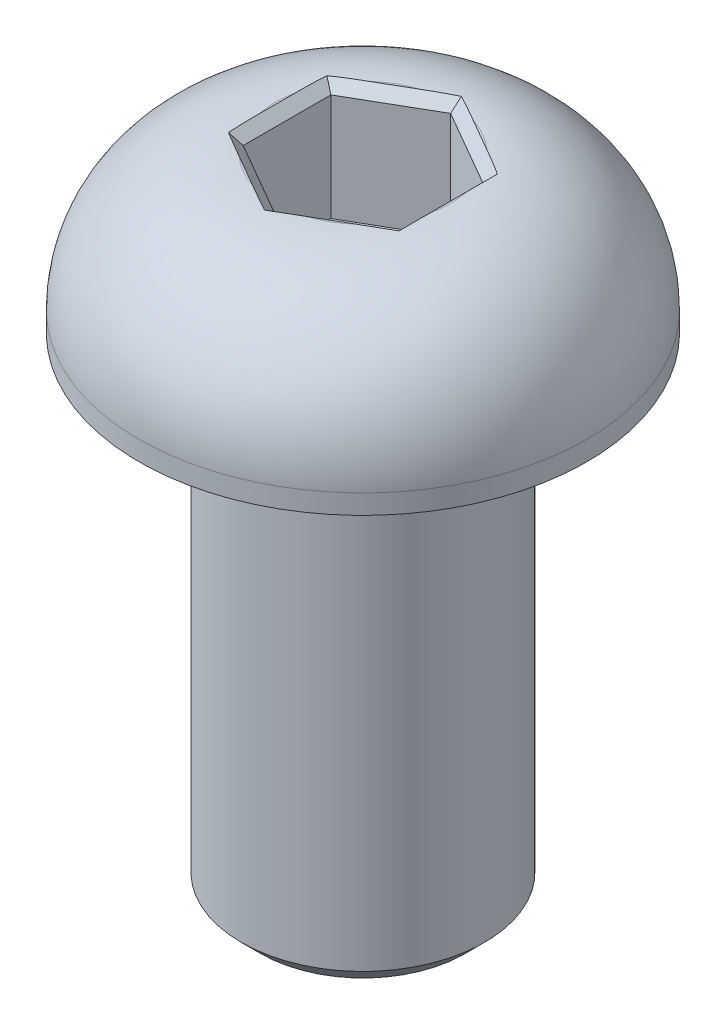
ISO-10303-21;
HEADER;
FILE_DESCRIPTION(('STEP AP214'),'2;1');
FILE_NAME('part.step','',(''),(''),'','','');
FILE_SCHEMA(('AUTOMOTIVE_DESIGN { 1 0 10303 214 1 1 1 1 }'));
ENDSEC;
DATA;
#1=APPLICATION_CONTEXT('core data for automotive mechanical design processes');
#2=APPLICATION_PROTOCOL_DEFINITION('international standard','automotive_design',2000,#1);
#3=PRODUCT_CONTEXT('',#1,'mechanical');
#4=PRODUCT('Part','Part','',(#3));
#5=PRODUCT_RELATED_PRODUCT_CATEGORY('part','',(#4));
#6=PRODUCT_DEFINITION_FORMATION('','',#4);
#7=PRODUCT_DEFINITION_CONTEXT('part definition',#1,'design');
#8=PRODUCT_DEFINITION('design','',#6,#7);
#9=PRODUCT_DEFINITION_SHAPE('','',#8);
#10=(LENGTH_UNIT() NAMED_UNIT(*) SI_UNIT(.MILLI.,.METRE.));
#11=(NAMED_UNIT(*) PLANE_ANGLE_UNIT() SI_UNIT($,.RADIAN.));
#12=(NAMED_UNIT(*) SI_UNIT($,.STERADIAN.) SOLID_ANGLE_UNIT());
#13=UNCERTAINTY_MEASURE_WITH_UNIT(LENGTH_MEASURE(1.E-05),#10,'distance_accuracy_value','');
#14=(GEOMETRIC_REPRESENTATION_CONTEXT(3) GLOBAL_UNCERTAINTY_ASSIGNED_CONTEXT((#13)) GLOBAL_UNIT_ASSIGNED_CONTEXT((#10,
#11,#12)) REPRESENTATION_CONTEXT('',''));
#15=CARTESIAN_POINT('',(0.,0.,0.));
#16=DIRECTION('',(0.,0.,1.));
#17=DIRECTION('',(1.,0.,0.));
#18=AXIS2_PLACEMENT_3D('',#15,#16,#17);
#19=CARTESIAN_POINT('',(-2.23519999999999,0.,0.));
#20=DIRECTION('',(-0.707106781186548,-0.707106781186548,0.));
#21=DIRECTION('',(0.707106781186548,-0.707106781186548,0.));
#22=AXIS2_PLACEMENT_3D('',#19,#20,#21);
#23=PLANE('',#22);
#24=CARTESIAN_POINT('',(-2.23519999999999,0.,-0.479246241508528));
#25=CARTESIAN_POINT('',(-2.23519545083094,-4.5491690521561E-06,-0.54633187498132));
#26=CARTESIAN_POINT('',(-2.23511717405976,-8.28259402306092E-05,-0.6134198498157));
#27=CARTESIAN_POINT('',(-2.23457539898931,-0.00062460101068055,-0.747580394081407));
#28=CARTESIAN_POINT('',(-2.23411196867061,-0.00108803132938383,-0.814652964142137));
#29=CARTESIAN_POINT('',(-2.23256218352199,-0.00263781647800325,-0.948795198174681));
#30=CARTESIAN_POINT('',(-2.23147574598861,-0.00372425401137726,-1.01586486057811));
#31=CARTESIAN_POINT('',(-2.22844173806789,-0.00675826193210111,-1.14997607876352));
#32=CARTESIAN_POINT('',(-2.22649401532764,-0.00870598467234656,-1.21701762747143));
#33=CARTESIAN_POINT('',(-2.22399670617113,-0.0112032938288596,-1.28402509698474));
#34=B_SPLINE_CURVE_WITH_KNOTS('',3,(#24,#25,#26,#27,#28,#29,#30,#31,#32,#33),.UNSPECIFIED.,.F.,
.F.,(4,2,2,2,4),(0.,0.201260421356997,0.402485327286571,0.603736951766037,0.805024189931098),.UNSPECIFIED.);
#35=CARTESIAN_POINT('',(-2.23519999999999,0.,-0.479246241508529));
#36=VERTEX_POINT('',#35);
#37=CARTESIAN_POINT('',(-2.22399670617113,-0.0112032938288605,-1.28402509698474));
#38=VERTEX_POINT('',#37);
#39=EDGE_CURVE('E143',#36,#38,#34,.T.);
#40=ORIENTED_EDGE('',*,*,#39,.F.);
#41=DIRECTION('',(0.,0.,1.));
#42=VECTOR('',#41,1.);
#43=CARTESIAN_POINT('',(-2.23519999999999,0.,0.));
#44=LINE('',#43,#42);
#45=CARTESIAN_POINT('',(-2.23519999999999,0.,0.479246241508528));
#46=VERTEX_POINT('',#45);
#47=EDGE_CURVE('E114',#46,#36,#44,.F.);
#48=ORIENTED_EDGE('',*,*,#47,.F.);
#49=CARTESIAN_POINT('',(-2.22399670617113,-0.0112032938288608,1.28402509698477));
#50=CARTESIAN_POINT('',(-2.22649401532764,-0.00870598467234749,1.21701762747146));
#51=CARTESIAN_POINT('',(-2.22844173806789,-0.00675826193210184,1.14997607876355));
#52=CARTESIAN_POINT('',(-2.23147574598861,-0.00372425401137765,1.01586486057813));
#53=CARTESIAN_POINT('',(-2.23256218352199,-0.0026378164780035,0.948795198174698));
#54=CARTESIAN_POINT('',(-2.23411196867061,-0.00108803132938387,0.814652964142149));
#55=CARTESIAN_POINT('',(-2.23457539898931,-0.000624601010680516,0.747580394081417));
#56=CARTESIAN_POINT('',(-2.23511717405976,-8.28259402305098E-05,0.613419849815705));
#57=CARTESIAN_POINT('',(-2.23519545083094,-4.54916905205781E-06,0.546331874981322));
#58=CARTESIAN_POINT('',(-2.23519999999999,0.,0.479246241508528));
#59=B_SPLINE_CURVE_WITH_KNOTS('',3,(#49,#50,#51,#52,#53,#54,#55,#56,#57,#58),.UNSPECIFIED.,.F.,
.F.,(4,2,2,2,4),(0.,0.201287238165069,0.402538862644542,0.603763768574124,0.805024189931128),.UNSPECIFIED.);
#60=CARTESIAN_POINT('',(-2.22399670617113,-0.0112032938288608,1.28402509698476));
#61=VERTEX_POINT('',#60);
#62=EDGE_CURVE('E21',#61,#46,#59,.T.);
#63=ORIENTED_EDGE('',*,*,#62,.F.);
#64=DIRECTION('',(0.654653670707967,-0.654653670707981,-0.377964473009239));
#65=VECTOR('',#64,1.);
#66=CARTESIAN_POINT('',(-2.22399670617113,-0.0112032938288579,1.28402509698476));
#67=LINE('',#66,#65);
#68=CARTESIAN_POINT('',(-1.98119999999999,-0.254000000000002,1.14384635331849));
#69=VERTEX_POINT('',#68);
#70=EDGE_CURVE('E105',#61,#69,#67,.T.);
#71=ORIENTED_EDGE('',*,*,#70,.T.);
#72=DIRECTION('',(0.,0.,-1.));
#73=VECTOR('',#72,1.);
#74=CARTESIAN_POINT('',(-1.98119999999999,-0.254000000000001,1.14384635331849));
#75=LINE('',#74,#73);
#76=CARTESIAN_POINT('',(-1.98119999999999,-0.254000000000001,-1.14384635331848));
#77=VERTEX_POINT('',#76);
#78=EDGE_CURVE('E163',#77,#69,#75,.F.);
#79=ORIENTED_EDGE('',*,*,#78,.F.);
#80=DIRECTION('',(-0.654653670707978,0.654653670707976,-0.377964473009226));
#81=VECTOR('',#80,1.);
#82=CARTESIAN_POINT('',(-1.98119999999999,-0.254000000000002,-1.14384635331848));
#83=LINE('',#82,#81);
#84=EDGE_CURVE('E353',#77,#38,#83,.T.);
#85=ORIENTED_EDGE('',*,*,#84,.T.);
#86=EDGE_LOOP('',(#40,#48,#63,#71,#79,#85));
#87=FACE_BOUND('',#86,.T.);
#88=ADVANCED_FACE('F16',(#87),#23,.F.);
#89=CARTESIAN_POINT('',(1.1176,0.,1.93573998253899));
#90=DIRECTION('',(0.353553390593274,-0.707106781186548,0.612372435695794));
#91=DIRECTION('',(0.,-0.654653670707977,-0.755928946018455));
#92=AXIS2_PLACEMENT_3D('',#89,#90,#91);
#93=PLANE('',#92);
#94=CARTESIAN_POINT('',(0.702560580185507,0.,2.17536310329319));
#95=CARTESIAN_POINT('',(0.644460442784563,-4.54916905213066E-06,2.20890198033363));
#96=CARTESIAN_POINT('',(0.58632141390394,-8.28259402305223E-05,2.24237817807846));
#97=CARTESIAN_POINT('',(0.469864086849047,-0.000624601010680477,2.30898925923718));
#98=CARTESIAN_POINT('',(0.411545822119983,-0.00108803132938384,2.34212420183867));
#99=CARTESIAN_POINT('',(0.294600347153073,-0.00263781647800355,2.40785316554584));
#100=CARTESIAN_POINT('',(0.23597309692176,-0.00372425401137779,2.44044711424403));
#101=CARTESIAN_POINT('',(0.118312371080335,-0.00675826193210222,2.50487519540212));
#102=CARTESIAN_POINT('',(0.0592788254201039,-0.00870598467234802,2.53670919238349));
#103=CARTESIAN_POINT('',(0.,-0.0112032938288615,2.56805019396951));
#104=B_SPLINE_CURVE_WITH_KNOTS('',3,(#94,#95,#96,#97,#98,#99,#100,#101,#102,#103),.UNSPECIFIED.,
.F.,.F.,(4,2,2,2,4),(0.,0.201260421357029,0.402485327286636,0.603736951766134,
0.805024189931228),.UNSPECIFIED.);
#105=CARTESIAN_POINT('',(0.702560580185491,0.,2.1753631032932));
#106=VERTEX_POINT('',#105);
#107=CARTESIAN_POINT('',(0.,-0.0112032938288617,2.56805019396951));
#108=VERTEX_POINT('',#107);
#109=EDGE_CURVE('E136',#106,#108,#104,.T.);
#110=ORIENTED_EDGE('',*,*,#109,.F.);
#111=DIRECTION('',(-0.866025403784439,0.,0.5));
#112=VECTOR('',#111,1.);
#113=CARTESIAN_POINT('',(1.53263941981452,0.,1.69611686178477));
#114=LINE('',#113,#112);
#115=CARTESIAN_POINT('',(1.53263941981452,0.,1.69611686178477));
#116=VERTEX_POINT('',#115);
#117=EDGE_CURVE('E139',#116,#106,#114,.T.);
#118=ORIENTED_EDGE('',*,*,#117,.F.);
#119=CARTESIAN_POINT('',(2.22399670617116,-0.0112032938288619,1.28402509698474));
#120=CARTESIAN_POINT('',(2.16721518990757,-0.00870598467234795,1.31969156491205));
#121=CARTESIAN_POINT('',(2.11012936698759,-0.00675826193210205,1.35489911663859));
#122=CARTESIAN_POINT('',(1.99550264906689,-0.00372425401137771,1.42458225366594));
#123=CARTESIAN_POINT('',(1.93796183636895,-0.00263781647800366,1.45905796737118));
#124=CARTESIAN_POINT('',(1.82256614655066,-0.00108803132938403,1.52747123769658));
#125=CARTESIAN_POINT('',(1.7647113121403,-0.000624601010680579,1.56140886515583));
#126=CARTESIAN_POINT('',(1.64879576015586,-8.28259402304328E-05,1.62895832826284));
#127=CARTESIAN_POINT('',(1.59073500804641,-4.54916905194507E-06,1.6625701053524));
#128=CARTESIAN_POINT('',(1.53263941981452,0.,1.69611686178477));
#129=B_SPLINE_CURVE_WITH_KNOTS('',3,(#119,#120,#121,#122,#123,#124,#125,#126,#127,#128),
.UNSPECIFIED.,.F.,.F.,(4,2,2,2,4),(0.,0.201287238165093,0.40253886264459,0.603763768574196,
0.805024189931224),.UNSPECIFIED.);
#130=CARTESIAN_POINT('',(2.22399670617116,-0.0112032938288619,1.28402509698475));
#131=VERTEX_POINT('',#130);
#132=EDGE_CURVE('E141',#131,#116,#129,.T.);
#133=ORIENTED_EDGE('',*,*,#132,.F.);
#134=DIRECTION('',(-0.654653670707979,-0.654653670707979,-0.377964473009222));
#135=VECTOR('',#134,1.);
#136=CARTESIAN_POINT('',(2.22399670617115,-0.0112032938288602,1.28402509698475));
#137=LINE('',#136,#135);
#138=CARTESIAN_POINT('',(1.98120000000001,-0.254000000000001,1.14384635331849));
#139=VERTEX_POINT('',#138);
#140=EDGE_CURVE('E123',#131,#139,#137,.T.);
#141=ORIENTED_EDGE('',*,*,#140,.T.);
#142=DIRECTION('',(-0.866025403784439,0.,0.5));
#143=VECTOR('',#142,1.);
#144=CARTESIAN_POINT('',(1.98120000000001,-0.254,1.14384635331849));
#145=LINE('',#144,#143);
#146=CARTESIAN_POINT('',(0.,-0.254000000000001,2.28769270663698));
#147=VERTEX_POINT('',#146);
#148=EDGE_CURVE('E165',#147,#139,#145,.F.);
#149=ORIENTED_EDGE('',*,*,#148,.F.);
#150=DIRECTION('',(0.,-0.654653670707977,-0.755928946018455));
#151=VECTOR('',#150,1.);
#152=CARTESIAN_POINT('',(0.,-0.319314285714288,2.21227426575884));
#153=LINE('',#152,#151);
#154=EDGE_CURVE('E133',#147,#108,#153,.F.);
#155=ORIENTED_EDGE('',*,*,#154,.T.);
#156=EDGE_LOOP('',(#110,#118,#133,#141,#149,#155));
#157=FACE_BOUND('',#156,.T.);
#158=ADVANCED_FACE('F374',(#157),#93,.F.);
#159=CARTESIAN_POINT('',(-1.1176,0.,1.93573998253898));
#160=DIRECTION('',(-0.353553390593274,-0.707106781186548,0.612372435695794));
#161=DIRECTION('',(0.,-0.654653670707977,-0.755928946018455));
#162=AXIS2_PLACEMENT_3D('',#159,#160,#161);
#163=PLANE('',#162);
#164=CARTESIAN_POINT('',(-1.53263941981454,0.,1.69611686178475));
#165=CARTESIAN_POINT('',(-1.59073500804643,-4.54916905217606E-06,1.66257010535238));
#166=CARTESIAN_POINT('',(-1.64879576015587,-8.28259402304666E-05,1.62895832826283));
#167=CARTESIAN_POINT('',(-1.7647113121403,-0.000624601010680219,1.56140886515582));
#168=CARTESIAN_POINT('',(-1.82256614655066,-0.00108803132938348,1.52747123769657));
#169=CARTESIAN_POINT('',(-1.93796183636894,-0.00263781647800301,1.45905796737118));
#170=CARTESIAN_POINT('',(-1.99550264906688,-0.00372425401137715,1.42458225366593));
#171=CARTESIAN_POINT('',(-2.11012936698757,-0.00675826193210139,1.35489911663859));
#172=CARTESIAN_POINT('',(-2.16721518990755,-0.0087059846723471,1.31969156491205));
#173=CARTESIAN_POINT('',(-2.22399670617114,-0.0112032938288604,1.28402509698475));
#174=B_SPLINE_CURVE_WITH_KNOTS('',3,(#164,#165,#166,#167,#168,#169,#170,#171,#172,#173),
.UNSPECIFIED.,.F.,.F.,(4,2,2,2,4),(0.,0.201260421357015,0.402485327286608,0.603736951766091,
0.805024189931171),.UNSPECIFIED.);
#175=CARTESIAN_POINT('',(-1.53263941981454,0.,1.69611686178475));
#176=VERTEX_POINT('',#175);
#177=EDGE_CURVE('E94',#176,#61,#174,.T.);
#178=ORIENTED_EDGE('',*,*,#177,.F.);
#179=DIRECTION('',(-0.866025403784439,0.,-0.5));
#180=VECTOR('',#179,1.);
#181=CARTESIAN_POINT('',(-0.702560580185463,0.,2.17536310329321));
#182=LINE('',#181,#180);
#183=CARTESIAN_POINT('',(-0.702560580185463,0.,2.17536310329321));
#184=VERTEX_POINT('',#183);
#185=EDGE_CURVE('E106',#184,#176,#182,.T.);
#186=ORIENTED_EDGE('',*,*,#185,.F.);
#187=CARTESIAN_POINT('',(0.,-0.011203293828861,2.56805019396951));
#188=CARTESIAN_POINT('',(-0.0592788254200909,-0.00870598467234772,2.53670919238349));
#189=CARTESIAN_POINT('',(-0.118312371080319,-0.00675826193210203,2.50487519540211));
#190=CARTESIAN_POINT('',(-0.235973096921738,-0.00372425401137776,2.44044711424403));
#191=CARTESIAN_POINT('',(-0.294600347153048,-0.00263781647800358,2.40785316554584));
#192=CARTESIAN_POINT('',(-0.411545822119952,-0.00108803132938388,2.34212420183867));
#193=CARTESIAN_POINT('',(-0.469864086849014,-0.000624601010680494,2.30898925923719));
#194=CARTESIAN_POINT('',(-0.586321413903901,-8.28259402304026E-05,2.24237817807847));
#195=CARTESIAN_POINT('',(-0.644460442784521,-4.54916905190398E-06,2.20890198033364));
#196=CARTESIAN_POINT('',(-0.702560580185462,0.,2.17536310329321));
#197=B_SPLINE_CURVE_WITH_KNOTS('',3,(#187,#188,#189,#190,#191,#192,#193,#194,#195,#196),
.UNSPECIFIED.,.F.,.F.,(4,2,2,2,4),(0.,0.201287238165084,0.402538862644572,0.603763768574169,
0.805024189931188),.UNSPECIFIED.);
#198=EDGE_CURVE('E132',#108,#184,#197,.T.);
#199=ORIENTED_EDGE('',*,*,#198,.F.);
#200=ORIENTED_EDGE('',*,*,#154,.F.);
#201=DIRECTION('',(-0.866025403784439,0.,-0.5));
#202=VECTOR('',#201,1.);
#203=CARTESIAN_POINT('',(0.,-0.254,2.28769270663698));
#204=LINE('',#203,#202);
#205=EDGE_CURVE('E119',#69,#147,#204,.F.);
#206=ORIENTED_EDGE('',*,*,#205,.F.);
#207=ORIENTED_EDGE('',*,*,#70,.F.);
#208=EDGE_LOOP('',(#178,#186,#199,#200,#206,#207));
#209=FACE_BOUND('',#208,.T.);
#210=ADVANCED_FACE('F116',(#209),#163,.F.);
#211=CARTESIAN_POINT('',(2.23520000000001,0.,0.));
#212=DIRECTION('',(0.707106781186548,-0.707106781186548,0.));
#213=DIRECTION('',(0.707106781186548,0.707106781186548,0.));
#214=AXIS2_PLACEMENT_3D('',#211,#212,#213);
#215=PLANE('',#214);
#216=CARTESIAN_POINT('',(2.22399670617115,-0.0112032938288609,-1.28402509698474));
#217=CARTESIAN_POINT('',(2.22649401532766,-0.00870598467234712,-1.21701762747142));
#218=CARTESIAN_POINT('',(2.22844173806791,-0.00675826193210139,-1.14997607876351));
#219=CARTESIAN_POINT('',(2.23147574598863,-0.00372425401137733,-1.01586486057808));
#220=CARTESIAN_POINT('',(2.23256218352201,-0.00263781647800338,-0.948795198174644));
#221=CARTESIAN_POINT('',(2.23411196867063,-0.00108803132938389,-0.814652964142084));
#222=CARTESIAN_POINT('',(2.23457539898933,-0.000624601010680465,-0.747580394081347));
#223=CARTESIAN_POINT('',(2.23511717405978,-8.28259402303114E-05,-0.613419849815625));
#224=CARTESIAN_POINT('',(2.23519545083096,-4.54916905178455E-06,-0.546331874981238));
#225=CARTESIAN_POINT('',(2.23520000000001,0.,-0.479246241508439));
#226=B_SPLINE_CURVE_WITH_KNOTS('',3,(#216,#217,#218,#219,#220,#221,#222,#223,#224,#225),
.UNSPECIFIED.,.F.,.F.,(4,2,2,2,4),(0.,0.201287238165083,0.402538862644571,0.603763768574168,
0.805024189931187),.UNSPECIFIED.);
#227=CARTESIAN_POINT('',(2.22399670617115,-0.0112032938288607,-1.28402509698474));
#228=VERTEX_POINT('',#227);
#229=CARTESIAN_POINT('',(2.23520000000001,0.,-0.479246241508439));
#230=VERTEX_POINT('',#229);
#231=EDGE_CURVE('E354',#228,#230,#226,.T.);
#232=ORIENTED_EDGE('',*,*,#231,.F.);
#233=DIRECTION('',(0.654653670707979,0.654653670707979,-0.377964473009222));
#234=VECTOR('',#233,1.);
#235=CARTESIAN_POINT('',(1.98120000000001,-0.254,-1.14384635331848));
#236=LINE('',#235,#234);
#237=CARTESIAN_POINT('',(1.98120000000001,-0.254000000000001,-1.14384635331848));
#238=VERTEX_POINT('',#237);
#239=EDGE_CURVE('E359',#238,#228,#236,.T.);
#240=ORIENTED_EDGE('',*,*,#239,.F.);
#241=DIRECTION('',(0.,0.,1.));
#242=VECTOR('',#241,1.);
#243=CARTESIAN_POINT('',(1.98120000000001,-0.254000000000001,-1.14384635331848));
#244=LINE('',#243,#242);
#245=EDGE_CURVE('E148',#139,#238,#244,.F.);
#246=ORIENTED_EDGE('',*,*,#245,.F.);
#247=ORIENTED_EDGE('',*,*,#140,.F.);
#248=CARTESIAN_POINT('',(2.23520000000001,0.,0.479246241508439));
#249=CARTESIAN_POINT('',(2.23519545083096,-4.54916905199079E-06,0.54633187498124));
#250=CARTESIAN_POINT('',(2.23511717405978,-8.2825940230476E-05,0.613419849815629));
#251=CARTESIAN_POINT('',(2.23457539898933,-0.00062460101068062,0.747580394081356));
#252=CARTESIAN_POINT('',(2.23411196867063,-0.00108803132938407,0.814652964142094));
#253=CARTESIAN_POINT('',(2.23256218352201,-0.00263781647800372,0.948795198174658));
#254=CARTESIAN_POINT('',(2.23147574598863,-0.00372425401137778,1.0158648605781));
#255=CARTESIAN_POINT('',(2.22844173806791,-0.00675826193210213,1.14997607876353));
#256=CARTESIAN_POINT('',(2.22649401532766,-0.00870598467234803,1.21701762747144));
#257=CARTESIAN_POINT('',(2.22399670617115,-0.011203293828862,1.28402509698476));
#258=B_SPLINE_CURVE_WITH_KNOTS('',3,(#248,#249,#250,#251,#252,#253,#254,#255,#256,#257),
.UNSPECIFIED.,.F.,.F.,(4,2,2,2,4),(0.,0.201260421357025,0.402485327286628,0.603736951766122,
0.805024189931211),.UNSPECIFIED.);
#259=CARTESIAN_POINT('',(2.23520000000001,0.,0.479246241508439));
#260=VERTEX_POINT('',#259);
#261=EDGE_CURVE('E121',#260,#131,#258,.T.);
#262=ORIENTED_EDGE('',*,*,#261,.F.);
#263=DIRECTION('',(0.,0.,1.));
#264=VECTOR('',#263,1.);
#265=CARTESIAN_POINT('',(2.23520000000001,0.,0.));
#266=LINE('',#265,#264);
#267=EDGE_CURVE('E358',#230,#260,#266,.T.);
#268=ORIENTED_EDGE('',*,*,#267,.F.);
#269=EDGE_LOOP('',(#232,#240,#246,#247,#262,#268));
#270=FACE_BOUND('',#269,.T.);
#271=ADVANCED_FACE('F337',(#270),#215,.F.);
#272=CARTESIAN_POINT('',(-1.1176,0.,-1.93573998253897));
#273=DIRECTION('',(-0.353553390593274,-0.707106781186548,-0.612372435695794));
#274=DIRECTION('',(0.,0.654653670707977,-0.755928946018455));
#275=AXIS2_PLACEMENT_3D('',#272,#273,#274);
#276=PLANE('',#275);
#277=CARTESIAN_POINT('',(-0.702560580185405,0.,-2.17536310329323));
#278=CARTESIAN_POINT('',(-0.644460442784469,-4.54916905177024E-06,-2.20890198033366));
#279=CARTESIAN_POINT('',(-0.586321413903855,-8.28259402302688E-05,-2.24237817807849));
#280=CARTESIAN_POINT('',(-0.469864086848978,-0.000624601010680577,-2.3089892592372));
#281=CARTESIAN_POINT('',(-0.411545822119921,-0.00108803132938418,-2.34212420183868));
#282=CARTESIAN_POINT('',(-0.294600347153028,-0.00263781647800368,-2.40785316554584));
#283=CARTESIAN_POINT('',(-0.235973096921723,-0.00372425401137744,-2.44044711424403));
#284=CARTESIAN_POINT('',(-0.118312371080315,-0.00675826193210108,-2.50487519540211));
#285=CARTESIAN_POINT('',(-0.0592788254200919,-0.00870598467234657,-2.53670919238348));
#286=CARTESIAN_POINT('',(0.,-0.0112032938288602,-2.56805019396949));
#287=B_SPLINE_CURVE_WITH_KNOTS('',3,(#277,#278,#279,#280,#281,#282,#283,#284,#285,#286),
.UNSPECIFIED.,.F.,.F.,(4,2,2,2,4),(0.,0.201260421357001,0.40248532728658,0.60373695176605,
0.805024189931116),.UNSPECIFIED.);
#288=CARTESIAN_POINT('',(-0.702560580185404,0.,-2.17536310329323));
#289=VERTEX_POINT('',#288);
#290=CARTESIAN_POINT('',(0.,-0.0112032938288604,-2.5680501939695));
#291=VERTEX_POINT('',#290);
#292=EDGE_CURVE('E342',#289,#291,#287,.T.);
#293=ORIENTED_EDGE('',*,*,#292,.F.);
#294=DIRECTION('',(0.866025403784439,0.,-0.499999999999999));
#295=VECTOR('',#294,1.);
#296=CARTESIAN_POINT('',(-1.53263941981459,0.,-1.69611686178471));
#297=LINE('',#296,#295);
#298=CARTESIAN_POINT('',(-1.53263941981459,0.,-1.69611686178471));
#299=VERTEX_POINT('',#298);
#300=EDGE_CURVE('E352',#299,#289,#297,.T.);
#301=ORIENTED_EDGE('',*,*,#300,.F.);
#302=CARTESIAN_POINT('',(-2.22399670617113,-0.0112032938288597,-1.28402509698474));
#303=CARTESIAN_POINT('',(-2.16721518990755,-0.00870598467234669,-1.31969156491204));
#304=CARTESIAN_POINT('',(-2.11012936698757,-0.00675826193210136,-1.35489911663858));
#305=CARTESIAN_POINT('',(-1.99550264906689,-0.00372425401137769,-1.42458225366592));
#306=CARTESIAN_POINT('',(-1.93796183636896,-0.00263781647800374,-1.45905796737116));
#307=CARTESIAN_POINT('',(-1.82256614655069,-0.00108803132938408,-1.52747123769654));
#308=CARTESIAN_POINT('',(-1.76471131214033,-0.000624601010680504,-1.56140886515579));
#309=CARTESIAN_POINT('',(-1.64879576015591,-8.2825940230181E-05,-1.62895832826279));
#310=CARTESIAN_POINT('',(-1.59073500804647,-4.54916905164019E-06,-1.66257010535235));
#311=CARTESIAN_POINT('',(-1.53263941981459,0.,-1.69611686178471));
#312=B_SPLINE_CURVE_WITH_KNOTS('',3,(#302,#303,#304,#305,#306,#307,#308,#309,#310,#311),
.UNSPECIFIED.,.F.,.F.,(4,2,2,2,4),(0.,0.201287238165064,0.402538862644532,0.603763768574109,
0.805024189931108),.UNSPECIFIED.);
#313=EDGE_CURVE('E347',#38,#299,#312,.T.);
#314=ORIENTED_EDGE('',*,*,#313,.F.);
#315=ORIENTED_EDGE('',*,*,#84,.F.);
#316=DIRECTION('',(0.866025403784439,0.,-0.5));
#317=VECTOR('',#316,1.);
#318=CARTESIAN_POINT('',(-1.98119999999999,-0.254,-1.14384635331848));
#319=LINE('',#318,#317);
#320=CARTESIAN_POINT('',(0.,-0.254000000000001,-2.28769270663697));
#321=VERTEX_POINT('',#320);
#322=EDGE_CURVE('E144',#321,#77,#319,.F.);
#323=ORIENTED_EDGE('',*,*,#322,.F.);
#324=DIRECTION('',(0.,0.654653670707977,-0.755928946018455));
#325=VECTOR('',#324,1.);
#326=CARTESIAN_POINT('',(0.,-0.319314285714288,-2.21227426575883));
#327=LINE('',#326,#325);
#328=EDGE_CURVE('E166',#291,#321,#327,.F.);
#329=ORIENTED_EDGE('',*,*,#328,.F.);
#330=EDGE_LOOP('',(#293,#301,#314,#315,#323,#329));
#331=FACE_BOUND('',#330,.T.);
#332=ADVANCED_FACE('F332',(#331),#276,.F.);
#333=CARTESIAN_POINT('',(-1.98119999999999,-3.048,1.14384635331849));
#334=DIRECTION('',(1.,0.,0.));
#335=DIRECTION('',(0.,0.,-1.));
#336=AXIS2_PLACEMENT_3D('',#333,#334,#335);
#337=PLANE('',#336);
#338=DIRECTION('',(0.,1.,0.));
#339=VECTOR('',#338,1.);
#340=CARTESIAN_POINT('',(-1.98119999999999,-3.048,1.14384635331849));
#341=LINE('',#340,#339);
#342=CARTESIAN_POINT('',(-1.98119999999999,-3.048,1.14384635331849));
#343=VERTEX_POINT('',#342);
#344=EDGE_CURVE('E186',#343,#69,#341,.T.);
#345=ORIENTED_EDGE('',*,*,#344,.F.);
#346=DIRECTION('',(0.,0.,-1.));
#347=VECTOR('',#346,1.);
#348=CARTESIAN_POINT('',(-1.98119999999999,-3.048,0.));
#349=LINE('',#348,#347);
#350=CARTESIAN_POINT('',(-1.98119999999999,-3.048,-1.14384635331848));
#351=VERTEX_POINT('',#350);
#352=EDGE_CURVE('E171',#343,#351,#349,.T.);
#353=ORIENTED_EDGE('',*,*,#352,.T.);
#354=DIRECTION('',(0.,1.,0.));
#355=VECTOR('',#354,1.);
#356=CARTESIAN_POINT('',(-1.98119999999999,-3.048,-1.14384635331848));
#357=LINE('',#356,#355);
#358=EDGE_CURVE('E147',#77,#351,#357,.F.);
#359=ORIENTED_EDGE('',*,*,#358,.F.);
#360=ORIENTED_EDGE('',*,*,#78,.T.);
#361=EDGE_LOOP('',(#345,#353,#359,#360));
#362=FACE_BOUND('',#361,.T.);
#363=ADVANCED_FACE('F328',(#362),#337,.T.);
#364=CARTESIAN_POINT('',(1.98120000000001,-3.048,1.14384635331849));
#365=DIRECTION('',(-0.5,0.,-0.866025403784439));
#366=DIRECTION('',(-0.866025403784439,0.,0.5));
#367=AXIS2_PLACEMENT_3D('',#364,#365,#366);
#368=PLANE('',#367);
#369=DIRECTION('',(0.,1.,0.));
#370=VECTOR('',#369,1.);
#371=CARTESIAN_POINT('',(1.98120000000001,-3.048,1.14384635331849));
#372=LINE('',#371,#370);
#373=CARTESIAN_POINT('',(1.98120000000001,-3.048,1.14384635331849));
#374=VERTEX_POINT('',#373);
#375=EDGE_CURVE('E176',#374,#139,#372,.T.);
#376=ORIENTED_EDGE('',*,*,#375,.F.);
#377=DIRECTION('',(-0.866025403784438,0.,0.5));
#378=VECTOR('',#377,1.);
#379=CARTESIAN_POINT('',(1.98120000000001,-3.048,1.14384635331849));
#380=LINE('',#379,#378);
#381=CARTESIAN_POINT('',(0.,-3.048,2.28769270663698));
#382=VERTEX_POINT('',#381);
#383=EDGE_CURVE('E441',#374,#382,#380,.T.);
#384=ORIENTED_EDGE('',*,*,#383,.T.);
#385=DIRECTION('',(0.,1.,0.));
#386=VECTOR('',#385,1.);
#387=CARTESIAN_POINT('',(0.,-3.048,2.28769270663698));
#388=LINE('',#387,#386);
#389=EDGE_CURVE('E191',#147,#382,#388,.F.);
#390=ORIENTED_EDGE('',*,*,#389,.F.);
#391=ORIENTED_EDGE('',*,*,#148,.T.);
#392=EDGE_LOOP('',(#376,#384,#390,#391));
#393=FACE_BOUND('',#392,.T.);
#394=ADVANCED_FACE('F324',(#393),#368,.T.);
#395=CARTESIAN_POINT('',(0.,-3.048,2.28769270663698));
#396=DIRECTION('',(0.5,0.,-0.866025403784439));
#397=DIRECTION('',(-0.866025403784439,0.,-0.5));
#398=AXIS2_PLACEMENT_3D('',#395,#396,#397);
#399=PLANE('',#398);
#400=ORIENTED_EDGE('',*,*,#389,.T.);
#401=DIRECTION('',(-0.866025403784438,0.,-0.500000000000002));
#402=VECTOR('',#401,1.);
#403=CARTESIAN_POINT('',(0.,-3.048,2.28769270663698));
#404=LINE('',#403,#402);
#405=EDGE_CURVE('E181',#382,#343,#404,.T.);
#406=ORIENTED_EDGE('',*,*,#405,.T.);
#407=ORIENTED_EDGE('',*,*,#344,.T.);
#408=ORIENTED_EDGE('',*,*,#205,.T.);
#409=EDGE_LOOP('',(#400,#406,#407,#408));
#410=FACE_BOUND('',#409,.T.);
#411=ADVANCED_FACE('F320',(#410),#399,.T.);
#412=CARTESIAN_POINT('',(1.98120000000001,-3.048,-1.14384635331848));
#413=DIRECTION('',(-1.,0.,0.));
#414=DIRECTION('',(0.,0.,1.));
#415=AXIS2_PLACEMENT_3D('',#412,#413,#414);
#416=PLANE('',#415);
#417=DIRECTION('',(0.,1.,0.));
#418=VECTOR('',#417,1.);
#419=CARTESIAN_POINT('',(1.98120000000001,-3.048,-1.14384635331848));
#420=LINE('',#419,#418);
#421=CARTESIAN_POINT('',(1.98120000000001,-3.048,-1.14384635331848));
#422=VERTEX_POINT('',#421);
#423=EDGE_CURVE('E155',#422,#238,#420,.T.);
#424=ORIENTED_EDGE('',*,*,#423,.F.);
#425=DIRECTION('',(0.,0.,-1.));
#426=VECTOR('',#425,1.);
#427=CARTESIAN_POINT('',(1.98120000000001,-3.048,0.));
#428=LINE('',#427,#426);
#429=EDGE_CURVE('E433',#422,#374,#428,.F.);
#430=ORIENTED_EDGE('',*,*,#429,.T.);
#431=ORIENTED_EDGE('',*,*,#375,.T.);
#432=ORIENTED_EDGE('',*,*,#245,.T.);
#433=EDGE_LOOP('',(#424,#430,#431,#432));
#434=FACE_BOUND('',#433,.T.);
#435=ADVANCED_FACE('F316',(#434),#416,.T.);
#436=CARTESIAN_POINT('',(-1.98119999999999,-3.048,-1.14384635331848));
#437=DIRECTION('',(0.5,0.,0.866025403784439));
#438=DIRECTION('',(0.866025403784439,0.,-0.5));
#439=AXIS2_PLACEMENT_3D('',#436,#437,#438);
#440=PLANE('',#439);
#441=ORIENTED_EDGE('',*,*,#358,.T.);
#442=DIRECTION('',(0.866025403784438,0.,-0.500000000000002));
#443=VECTOR('',#442,1.);
#444=CARTESIAN_POINT('',(-1.98119999999999,-3.048,-1.14384635331848));
#445=LINE('',#444,#443);
#446=CARTESIAN_POINT('',(0.,-3.048,-2.28769270663697));
#447=VERTEX_POINT('',#446);
#448=EDGE_CURVE('E442',#351,#447,#445,.T.);
#449=ORIENTED_EDGE('',*,*,#448,.T.);
#450=DIRECTION('',(0.,1.,0.));
#451=VECTOR('',#450,1.);
#452=CARTESIAN_POINT('',(0.,-3.048,-2.28769270663697));
#453=LINE('',#452,#451);
#454=EDGE_CURVE('E151',#321,#447,#453,.F.);
#455=ORIENTED_EDGE('',*,*,#454,.F.);
#456=ORIENTED_EDGE('',*,*,#322,.T.);
#457=EDGE_LOOP('',(#441,#449,#455,#456));
#458=FACE_BOUND('',#457,.T.);
#459=ADVANCED_FACE('F312',(#458),#440,.T.);
#460=CARTESIAN_POINT('',(-3.96239999999999,-3.048,0.));
#461=DIRECTION('',(0.,-1.,0.));
#462=DIRECTION('',(0.,0.,-1.));
#463=AXIS2_PLACEMENT_3D('',#460,#461,#462);
#464=PLANE('',#463);
#465=ORIENTED_EDGE('',*,*,#383,.F.);
#466=ORIENTED_EDGE('',*,*,#429,.F.);
#467=DIRECTION('',(0.866025403784439,0.,0.5));
#468=VECTOR('',#467,1.);
#469=CARTESIAN_POINT('',(0.,-3.048,-2.28769270663697));
#470=LINE('',#469,#468);
#471=EDGE_CURVE('E154',#447,#422,#470,.T.);
#472=ORIENTED_EDGE('',*,*,#471,.F.);
#473=ORIENTED_EDGE('',*,*,#448,.F.);
#474=ORIENTED_EDGE('',*,*,#352,.F.);
#475=ORIENTED_EDGE('',*,*,#405,.F.);
#476=EDGE_LOOP('',(#465,#466,#472,#473,#474,#475));
#477=FACE_BOUND('',#476,.T.);
#478=ADVANCED_FACE('F308',(#477),#464,.F.);
#479=CARTESIAN_POINT('',(0.,-3.048,-2.28769270663697));
#480=DIRECTION('',(-0.5,0.,0.866025403784439));
#481=DIRECTION('',(0.866025403784439,0.,0.5));
#482=AXIS2_PLACEMENT_3D('',#479,#480,#481);
#483=PLANE('',#482);
#484=ORIENTED_EDGE('',*,*,#454,.T.);
#485=ORIENTED_EDGE('',*,*,#471,.T.);
#486=ORIENTED_EDGE('',*,*,#423,.T.);
#487=DIRECTION('',(-0.866025403784439,0.,-0.5));
#488=VECTOR('',#487,1.);
#489=CARTESIAN_POINT('',(1.98120000000001,-0.254000000000002,-1.14384635331848));
#490=LINE('',#489,#488);
#491=EDGE_CURVE('E158',#238,#321,#490,.T.);
#492=ORIENTED_EDGE('',*,*,#491,.T.);
#493=EDGE_LOOP('',(#484,#485,#486,#492));
#494=FACE_BOUND('',#493,.T.);
#495=ADVANCED_FACE('F304',(#494),#483,.T.);
#496=CARTESIAN_POINT('',(0.,0.,0.));
#497=DIRECTION('',(0.,1.,0.));
#498=DIRECTION('',(0.,0.,1.));
#499=AXIS2_PLACEMENT_3D('',#496,#497,#498);
#500=PLANE('',#499);
#501=ORIENTED_EDGE('',*,*,#267,.T.);
#502=CARTESIAN_POINT('',(2.23520000000001,0.,-0.479246241508439));
#503=CARTESIAN_POINT('',(2.2436351732995,-7.75883991060415E-11,-0.439904613665568));
#504=CARTESIAN_POINT('',(2.25104301452943,8.32133583520682E-11,-0.400342500516213));
#505=CARTESIAN_POINT('',(2.26378538053206,-4.49290933204521E-10,-0.320884508202559));
#506=CARTESIAN_POINT('',(2.26911983972401,-1.14262399548098E-09,-0.280988618521724));
#507=CARTESIAN_POINT('',(2.27769652588812,-4.71456039984013E-09,-0.200970237588074));
#508=CARTESIAN_POINT('',(2.28093861988209,-7.59330260812905E-09,-0.16084773209635));
#509=CARTESIAN_POINT('',(2.28533794426537,-2.20588019553739E-08,-0.0804844709461859));
#510=CARTESIAN_POINT('',(2.28649497559781,-3.36463903612688E-08,-0.0402437043648736));
#511=CARTESIAN_POINT('',(2.28665957769093,-6.00679754615812E-08,0.0402475427660686));
#512=CARTESIAN_POINT('',(2.28566694342785,-7.49022816895121E-08,0.0804980238761305));
#513=CARTESIAN_POINT('',(2.28147402934488,-8.65335738464443E-08,0.160885333079821));
#514=CARTESIAN_POINT('',(2.2782736841804,-8.33300258646649E-08,0.201022157774098));
#515=CARTESIAN_POINT('',(2.26969072896804,-6.30976032257312E-08,0.281059032688881));
#516=CARTESIAN_POINT('',(2.26430825391593,-4.60695837434686E-08,0.320959097401457));
#517=CARTESIAN_POINT('',(2.25137593218619,-1.57981655646206E-08,0.400400094393689));
#518=CARTESIAN_POINT('',(2.24382641792857,-2.55418702407334E-09,0.43994108079633));
#519=CARTESIAN_POINT('',(2.23520000000001,0.,0.479246241508439));
#520=B_SPLINE_CURVE_WITH_KNOTS('',3,(#502,#503,#504,#505,#506,#507,#508,#509,#510,#511,#512,
#513,#514,#515,#516,#517,#518,#519),.UNSPECIFIED.,.F.,.F.,(4,2,2,2,2,2,2,2,4),(0.,
0.120694007132202,0.241391831486739,0.36209732591626,0.482814343253623,0.603542874450131,
0.724274979165001,0.844999616021264,0.965705743817626),.UNSPECIFIED.);
#521=EDGE_CURVE('E209',#230,#260,#520,.T.);
#522=ORIENTED_EDGE('',*,*,#521,.F.);
#523=EDGE_LOOP('',(#501,#522));
#524=FACE_BOUND('',#523,.T.);
#525=ADVANCED_FACE('F300',(#524),#500,.T.);
#526=CARTESIAN_POINT('',(0.,0.,0.));
#527=DIRECTION('',(0.,1.,0.));
#528=DIRECTION('',(0.,0.,1.));
#529=AXIS2_PLACEMENT_3D('',#526,#527,#528);
#530=PLANE('',#529);
#531=ORIENTED_EDGE('',*,*,#117,.T.);
#532=CARTESIAN_POINT('',(1.53263941981452,0.,1.69611686178477));
#533=CARTESIAN_POINT('',(1.50278615732611,-7.75883991060245E-11,1.72309275006889));
#534=CARTESIAN_POINT('',(1.47222828292633,8.32133583520801E-11,1.74928918533588));
#535=CARTESIAN_POINT('',(1.40978682605032,-4.49290933204531E-10,1.80005339415531));
#536=CARTESIAN_POINT('',(1.37790320167611,-1.142623995481E-09,1.82462111617141));
#537=CARTESIAN_POINT('',(1.31289359409992,-4.71456039984012E-09,1.87205793473664));
#538=CARTESIAN_POINT('',(1.2797675320776,-7.59330260812901E-09,1.89492692324273));
#539=CARTESIAN_POINT('',(1.21237056858223,-2.20588019553739E-08,1.93891848049322));
#540=CARTESIAN_POINT('',(1.17809955812128,-3.36463903612689E-08,1.96004088231075));
#541=CARTESIAN_POINT('',(1.10847439437015,-6.00679754615812E-08,2.00042905547037));
#542=CARTESIAN_POINT('',(1.07312013808275,-7.49022816895121E-08,2.01969464953691));
#543=CARTESIAN_POINT('',(1.001406229129,-8.65335738464444E-08,2.05625713402701));
#544=CARTESIAN_POINT('',(0.965046546734268,-8.33300258646649E-08,2.07355396616083));
#545=CARTESIAN_POINT('',(0.891441102212369,-6.30976032257312E-08,2.10613934636478));
#546=CARTESIAN_POINT('',(0.854195395032583,-4.60695837434686E-08,2.1214280185907));
#547=CARTESIAN_POINT('',(0.778931312670478,-1.57981655646206E-08,2.14994879793895));
#548=CARTESIAN_POINT('',(0.740913056826287,-2.55418702407328E-09,2.16318122000694));
#549=CARTESIAN_POINT('',(0.702560580185491,0.,2.1753631032932));
#550=B_SPLINE_CURVE_WITH_KNOTS('',3,(#532,#533,#534,#535,#536,#537,#538,#539,#540,#541,#542,
#543,#544,#545,#546,#547,#548,#549),.UNSPECIFIED.,.F.,.F.,(4,2,2,2,2,2,2,2,4),(0.,
0.120694007132201,0.241391831486735,0.362097325916254,0.482814343253615,0.603542874450122,
0.72427497916499,0.844999616021251,0.965705743817611),.UNSPECIFIED.);
#551=EDGE_CURVE('E218',#116,#106,#550,.T.);
#552=ORIENTED_EDGE('',*,*,#551,.F.);
#553=EDGE_LOOP('',(#531,#552));
#554=FACE_BOUND('',#553,.T.);
#555=ADVANCED_FACE('F296',(#554),#530,.T.);
#556=CARTESIAN_POINT('',(0.,0.,0.));
#557=DIRECTION('',(0.,1.,0.));
#558=DIRECTION('',(0.,0.,1.));
#559=AXIS2_PLACEMENT_3D('',#556,#557,#558);
#560=PLANE('',#559);
#561=ORIENTED_EDGE('',*,*,#185,.T.);
#562=CARTESIAN_POINT('',(-0.702560580185464,0.,2.17536310329321));
#563=CARTESIAN_POINT('',(-0.74084901597337,-7.75883991060359E-11,2.16299736373446));
#564=CARTESIAN_POINT('',(-0.778814731603071,8.32133583520717E-11,2.1496316858521));
#565=CARTESIAN_POINT('',(-0.853998554481725,-4.49290933204524E-10,2.12093790235787));
#566=CARTESIAN_POINT('',(-0.891216638047886,-1.14262399548099E-09,2.10560973469313));
#567=CARTESIAN_POINT('',(-0.964802931788187,-4.71456039984012E-09,2.07302817232471));
#568=CARTESIAN_POINT('',(-1.00117108780449,-7.59330260812902E-09,2.05577465533909));
#569=CARTESIAN_POINT('',(-1.07296737568314,-2.20588019553739E-08,2.01940295143941));
#570=CARTESIAN_POINT('',(-1.10839541747653,-3.36463903612688E-08,2.00028458667562));
#571=CARTESIAN_POINT('',(-1.17818518332078,-6.00679754615812E-08,1.96018151270431));
#572=CARTESIAN_POINT('',(-1.2125468053451,-7.49022816895121E-08,1.93919662566078));
#573=CARTESIAN_POINT('',(-1.28006780021589,-8.65335738464444E-08,1.89537180094719));
#574=CARTESIAN_POINT('',(-1.31322713744614,-8.33300258646649E-08,1.87253180838673));
#575=CARTESIAN_POINT('',(-1.37824962675568,-6.30976032257312E-08,1.82508031367589));
#576=CARTESIAN_POINT('',(-1.41011285888336,-4.60695837434686E-08,1.80046892118924));
#577=CARTESIAN_POINT('',(-1.47244461951573,-1.57981655646205E-08,1.74954870354526));
#578=CARTESIAN_POINT('',(-1.5029133611023,-2.55418702407313E-09,1.7232401392106));
#579=CARTESIAN_POINT('',(-1.53263941981454,0.,1.69611686178475));
#580=B_SPLINE_CURVE_WITH_KNOTS('',3,(#562,#563,#564,#565,#566,#567,#568,#569,#570,#571,#572,
#573,#574,#575,#576,#577,#578,#579),.UNSPECIFIED.,.F.,.F.,(4,2,2,2,2,2,2,2,4),(0.,
0.120694007132208,0.24139183148675,0.362097325916277,0.482814343253645,0.603542874450159,
0.724274979165033,0.844999616021302,0.965705743817669),.UNSPECIFIED.);
#581=EDGE_CURVE('E101',#184,#176,#580,.T.);
#582=ORIENTED_EDGE('',*,*,#581,.F.);
#583=EDGE_LOOP('',(#561,#582));
#584=FACE_BOUND('',#583,.T.);
#585=ADVANCED_FACE('F292',(#584),#560,.T.);
#586=CARTESIAN_POINT('',(0.,0.,0.));
#587=DIRECTION('',(0.,1.,0.));
#588=DIRECTION('',(0.,0.,1.));
#589=AXIS2_PLACEMENT_3D('',#586,#587,#588);
#590=PLANE('',#589);
#591=ORIENTED_EDGE('',*,*,#47,.T.);
#592=CARTESIAN_POINT('',(-2.23519999999999,0.,0.479246241508528));
#593=CARTESIAN_POINT('',(-2.24363517329948,-7.75883991060931E-11,0.43990461366565));
#594=CARTESIAN_POINT('',(-2.25104301452941,8.32133583520363E-11,0.400342500516288));
#595=CARTESIAN_POINT('',(-2.26378538053205,-4.49290933204492E-10,0.320884508202619));
#596=CARTESIAN_POINT('',(-2.269119839724,-1.14262399548092E-09,0.280988618521777));
#597=CARTESIAN_POINT('',(-2.27769652588812,-4.71456039984016E-09,0.200970237588111));
#598=CARTESIAN_POINT('',(-2.28093861988209,-7.59330260812915E-09,0.160847732096381));
#599=CARTESIAN_POINT('',(-2.28533794426537,-2.20588019553739E-08,0.0804844709462012));
#600=CARTESIAN_POINT('',(-2.28649497559781,-3.36463903612687E-08,0.0402437043648811));
#601=CARTESIAN_POINT('',(-2.28665957769093,-6.00679754615811E-08,-0.0402475427660762));
#602=CARTESIAN_POINT('',(-2.28566694342785,-7.49022816895121E-08,-0.0804980238761453));
#603=CARTESIAN_POINT('',(-2.28147402934488,-8.65335738464444E-08,-0.16088533307985));
#604=CARTESIAN_POINT('',(-2.27827368418039,-8.33300258646648E-08,-0.201022157774135));
#605=CARTESIAN_POINT('',(-2.26969072896803,-6.30976032257311E-08,-0.281059032688934));
#606=CARTESIAN_POINT('',(-2.26430825391592,-4.60695837434686E-08,-0.320959097401518));
#607=CARTESIAN_POINT('',(-2.25137593218618,-1.5798165564621E-08,-0.400400094393766));
#608=CARTESIAN_POINT('',(-2.24382641792855,-2.55418702407397E-09,-0.439941080796413));
#609=CARTESIAN_POINT('',(-2.23519999999999,0.,-0.479246241508529));
#610=B_SPLINE_CURVE_WITH_KNOTS('',3,(#592,#593,#594,#595,#596,#597,#598,#599,#600,#601,#602,
#603,#604,#605,#606,#607,#608,#609),.UNSPECIFIED.,.F.,.F.,(4,2,2,2,2,2,2,2,4),(0.,
0.120694007132225,0.241391831486785,0.362097325916328,0.482814343253714,0.603542874450245,
0.724274979165137,0.844999616021426,0.965705743817809),.UNSPECIFIED.);
#611=EDGE_CURVE('E234',#46,#36,#610,.T.);
#612=ORIENTED_EDGE('',*,*,#611,.F.);
#613=EDGE_LOOP('',(#591,#612));
#614=FACE_BOUND('',#613,.T.);
#615=ADVANCED_FACE('F288',(#614),#590,.T.);
#616=CARTESIAN_POINT('',(0.,0.,0.));
#617=DIRECTION('',(0.,1.,0.));
#618=DIRECTION('',(0.,0.,1.));
#619=AXIS2_PLACEMENT_3D('',#616,#617,#618);
#620=PLANE('',#619);
#621=ORIENTED_EDGE('',*,*,#300,.T.);
#622=CARTESIAN_POINT('',(-1.53263941981459,0.,-1.69611686178471));
#623=CARTESIAN_POINT('',(-1.50278615732617,-7.7588399106049E-11,-1.72309275006884));
#624=CARTESIAN_POINT('',(-1.47222828292639,8.32133583520665E-11,-1.74928918533584));
#625=CARTESIAN_POINT('',(-1.40978682605037,-4.49290933204518E-10,-1.80005339415527));
#626=CARTESIAN_POINT('',(-1.37790320167615,-1.14262399548097E-09,-1.82462111617138));
#627=CARTESIAN_POINT('',(-1.31289359409996,-4.71456039984014E-09,-1.87205793473662));
#628=CARTESIAN_POINT('',(-1.27976753207762,-7.59330260812908E-09,-1.89492692324272));
#629=CARTESIAN_POINT('',(-1.21237056858225,-2.20588019553739E-08,-1.93891848049322));
#630=CARTESIAN_POINT('',(-1.17809955812128,-3.36463903612688E-08,-1.96004088231075));
#631=CARTESIAN_POINT('',(-1.10847439437014,-6.00679754615811E-08,-2.00042905547038));
#632=CARTESIAN_POINT('',(-1.07312013808274,-7.4902281689512E-08,-2.01969464953692));
#633=CARTESIAN_POINT('',(-1.00140622912897,-8.65335738464445E-08,-2.05625713402703));
#634=CARTESIAN_POINT('',(-0.965046546734234,-8.3330025864665E-08,-2.07355396616085));
#635=CARTESIAN_POINT('',(-0.89144110221232,-6.30976032257311E-08,-2.1061393463648));
#636=CARTESIAN_POINT('',(-0.854195395032526,-4.60695837434686E-08,-2.12142801859073));
#637=CARTESIAN_POINT('',(-0.778931312670407,-1.57981655646206E-08,-2.14994879793898));
#638=CARTESIAN_POINT('',(-0.740913056826208,-2.55418702407338E-09,-2.16318122000697));
#639=CARTESIAN_POINT('',(-0.702560580185404,0.,-2.17536310329323));
#640=B_SPLINE_CURVE_WITH_KNOTS('',3,(#622,#623,#624,#625,#626,#627,#628,#629,#630,#631,#632,
#633,#634,#635,#636,#637,#638,#639),.UNSPECIFIED.,.F.,.F.,(4,2,2,2,2,2,2,2,4),(0.,
0.120694007132224,0.241391831486781,0.362097325916323,0.482814343253707,0.603542874450237,
0.724274979165128,0.844999616021413,0.965705743817795),.UNSPECIFIED.);
#641=EDGE_CURVE('E242',#299,#289,#640,.T.);
#642=ORIENTED_EDGE('',*,*,#641,.F.);
#643=EDGE_LOOP('',(#621,#642));
#644=FACE_BOUND('',#643,.T.);
#645=ADVANCED_FACE('F285',(#644),#620,.T.);
#646=CARTESIAN_POINT('',(0.,0.,0.));
#647=DIRECTION('',(0.,1.,0.));
#648=DIRECTION('',(0.,0.,1.));
#649=AXIS2_PLACEMENT_3D('',#646,#647,#648);
#650=PLANE('',#649);
#651=DIRECTION('',(0.866025403784438,0.,0.500000000000001));
#652=VECTOR('',#651,1.);
#653=CARTESIAN_POINT('',(0.702560580185438,0.,-2.17536310329322));
#654=LINE('',#653,#652);
#655=CARTESIAN_POINT('',(0.702560580185438,0.,-2.17536310329322));
#656=VERTEX_POINT('',#655);
#657=CARTESIAN_POINT('',(1.53263941981456,0.,-1.69611686178473));
#658=VERTEX_POINT('',#657);
#659=EDGE_CURVE('E38',#656,#658,#654,.T.);
#660=ORIENTED_EDGE('',*,*,#659,.T.);
#661=CARTESIAN_POINT('',(0.702560580185438,0.,-2.17536310329322));
#662=CARTESIAN_POINT('',(0.740849015973347,-7.75883991059703E-11,-2.16299736373447));
#663=CARTESIAN_POINT('',(0.77881473160305,8.32133583521097E-11,-2.14963168585211));
#664=CARTESIAN_POINT('',(0.853998554481708,-4.49290933204559E-10,-2.12093790235788));
#665=CARTESIAN_POINT('',(0.891216638047872,-1.14262399548106E-09,-2.10560973469314));
#666=CARTESIAN_POINT('',(0.964802931788177,-4.71456039984009E-09,-2.07302817232472));
#667=CARTESIAN_POINT('',(1.00117108780448,-7.59330260812889E-09,-2.05577465533909));
#668=CARTESIAN_POINT('',(1.07296737568313,-2.20588019553739E-08,-2.01940295143941));
#669=CARTESIAN_POINT('',(1.10839541747653,-3.36463903612689E-08,-2.00028458667562));
#670=CARTESIAN_POINT('',(1.17818518332079,-6.00679754615813E-08,-1.96018151270431));
#671=CARTESIAN_POINT('',(1.21254680534511,-7.49022816895121E-08,-1.93919662566077));
#672=CARTESIAN_POINT('',(1.2800678002159,-8.65335738464442E-08,-1.89537180094719));
#673=CARTESIAN_POINT('',(1.31322713744615,-8.33300258646648E-08,-1.87253180838673));
#674=CARTESIAN_POINT('',(1.37824962675569,-6.30976032257312E-08,-1.82508031367588));
#675=CARTESIAN_POINT('',(1.41011285888338,-4.60695837434687E-08,-1.80046892118923));
#676=CARTESIAN_POINT('',(1.47244461951575,-1.57981655646208E-08,-1.74954870354524));
#677=CARTESIAN_POINT('',(1.50291336110232,-2.5541870240736E-09,-1.72324013921058));
#678=CARTESIAN_POINT('',(1.53263941981456,0.,-1.69611686178473));
#679=B_SPLINE_CURVE_WITH_KNOTS('',3,(#661,#662,#663,#664,#665,#666,#667,#668,#669,#670,#671,
#672,#673,#674,#675,#676,#677,#678),.UNSPECIFIED.,.F.,.F.,(4,2,2,2,2,2,2,2,4),(0.,
0.120694007132216,0.241391831486763,0.362097325916298,0.482814343253672,0.603542874450194,
0.724274979165075,0.844999616021351,0.965705743817724),.UNSPECIFIED.);
#680=EDGE_CURVE('E204',#656,#658,#679,.T.);
#681=ORIENTED_EDGE('',*,*,#680,.F.);
#682=EDGE_LOOP('',(#660,#681));
#683=FACE_BOUND('',#682,.T.);
#684=ADVANCED_FACE('F278',(#683),#650,.T.);
#685=CARTESIAN_POINT('',(1.1176,0.,-1.93573998253898));
#686=DIRECTION('',(0.353553390593273,-0.707106781186548,-0.612372435695794));
#687=DIRECTION('',(0.,0.654653670707977,-0.755928946018455));
#688=AXIS2_PLACEMENT_3D('',#685,#686,#687);
#689=PLANE('',#688);
#690=CARTESIAN_POINT('',(1.53263941981456,0.,-1.69611686178473));
#691=CARTESIAN_POINT('',(1.59073500804645,-4.54916905254949E-06,-1.66257010535237));
#692=CARTESIAN_POINT('',(1.64879576015589,-8.2825940231095E-05,-1.62895832826281));
#693=CARTESIAN_POINT('',(1.76471131214032,-0.000624601010681002,-1.56140886515581));
#694=CARTESIAN_POINT('',(1.82256614655068,-0.00108803132938416,-1.52747123769656));
#695=CARTESIAN_POINT('',(1.93796183636896,-0.00263781647800368,-1.45905796737117));
#696=CARTESIAN_POINT('',(1.99550264906689,-0.00372425401137792,-1.42458225366592));
#697=CARTESIAN_POINT('',(2.11012936698758,-0.0067582619321023,-1.35489911663858));
#698=CARTESIAN_POINT('',(2.16721518990757,-0.00870598467234805,-1.31969156491205));
#699=CARTESIAN_POINT('',(2.22399670617115,-0.0112032938288613,-1.28402509698474));
#700=B_SPLINE_CURVE_WITH_KNOTS('',3,(#690,#691,#692,#693,#694,#695,#696,#697,#698,#699),
.UNSPECIFIED.,.F.,.F.,(4,2,2,2,4),(0.,0.201260421357012,0.402485327286602,0.603736951766083,
0.80502418993116),.UNSPECIFIED.);
#701=EDGE_CURVE('E207',#658,#228,#700,.T.);
#702=ORIENTED_EDGE('',*,*,#701,.F.);
#703=ORIENTED_EDGE('',*,*,#659,.F.);
#704=CARTESIAN_POINT('',(0.,-0.0112032938288606,-2.5680501939695));
#705=CARTESIAN_POINT('',(0.0592788254201028,-0.0087059846723473,-2.53670919238348));
#706=CARTESIAN_POINT('',(0.118312371080328,-0.00675826193210167,-2.50487519540211));
#707=CARTESIAN_POINT('',(0.235973096921741,-0.00372425401137755,-2.44044711424403));
#708=CARTESIAN_POINT('',(0.294600347153047,-0.00263781647800344,-2.40785316554584));
#709=CARTESIAN_POINT('',(0.411545822119945,-0.00108803132938388,-2.34212420183868));
#710=CARTESIAN_POINT('',(0.469864086849003,-0.000624601010680558,-2.30898925923719));
#711=CARTESIAN_POINT('',(0.586321413903884,-8.28259402306016E-05,-2.24237817807848));
#712=CARTESIAN_POINT('',(0.644460442784501,-4.54916905217365E-06,-2.20890198033365));
#713=CARTESIAN_POINT('',(0.702560580185439,0.,-2.17536310329322));
#714=B_SPLINE_CURVE_WITH_KNOTS('',3,(#704,#705,#706,#707,#708,#709,#710,#711,#712,#713),
.UNSPECIFIED.,.F.,.F.,(4,2,2,2,4),(0.,0.201287238165072,0.40253886264455,0.603763768574136,
0.805024189931144),.UNSPECIFIED.);
#715=EDGE_CURVE('E208',#291,#656,#714,.T.);
#716=ORIENTED_EDGE('',*,*,#715,.F.);
#717=ORIENTED_EDGE('',*,*,#328,.T.);
#718=ORIENTED_EDGE('',*,*,#491,.F.);
#719=ORIENTED_EDGE('',*,*,#239,.T.);
#720=EDGE_LOOP('',(#702,#703,#716,#717,#718,#719));
#721=FACE_BOUND('',#720,.T.);
#722=ADVANCED_FACE('F273',(#721),#689,.F.);
#723=CARTESIAN_POINT('',(0.,-3.556,0.));
#724=DIRECTION('',(0.,1.,0.));
#725=DIRECTION('',(0.,0.,1.));
#726=AXIS2_PLACEMENT_3D('',#723,#724,#725);
#727=DEGENERATE_TOROIDAL_SURFACE('',#726,2.286,3.556,.T.);
#728=ORIENTED_EDGE('',*,*,#680,.T.);
#729=ORIENTED_EDGE('',*,*,#701,.T.);
#730=ORIENTED_EDGE('',*,*,#231,.T.);
#731=ORIENTED_EDGE('',*,*,#521,.T.);
#732=ORIENTED_EDGE('',*,*,#261,.T.);
#733=ORIENTED_EDGE('',*,*,#132,.T.);
#734=ORIENTED_EDGE('',*,*,#551,.T.);
#735=ORIENTED_EDGE('',*,*,#109,.T.);
#736=ORIENTED_EDGE('',*,*,#198,.T.);
#737=ORIENTED_EDGE('',*,*,#581,.T.);
#738=ORIENTED_EDGE('',*,*,#177,.T.);
#739=ORIENTED_EDGE('',*,*,#62,.T.);
#740=ORIENTED_EDGE('',*,*,#611,.T.);
#741=ORIENTED_EDGE('',*,*,#39,.T.);
#742=ORIENTED_EDGE('',*,*,#313,.T.);
#743=ORIENTED_EDGE('',*,*,#641,.T.);
#744=ORIENTED_EDGE('',*,*,#292,.T.);
#745=ORIENTED_EDGE('',*,*,#715,.T.);
#746=EDGE_LOOP('',(#728,#729,#730,#731,#732,#733,#734,#735,#736,#737,#738,#739,#740,#741,#742,
#743,#744,#745));
#747=FACE_BOUND('',#746,.T.);
#748=CARTESIAN_POINT('',(0.,-3.556,0.));
#749=DIRECTION('',(0.,-1.,0.));
#750=DIRECTION('',(0.,0.,-1.));
#751=AXIS2_PLACEMENT_3D('',#748,#749,#750);
#752=CIRCLE('',#751,5.842);
#753=CARTESIAN_POINT('',(0.,-3.556,-5.842));
#754=VERTEX_POINT('',#753);
#755=EDGE_CURVE('E262',#754,#754,#752,.T.);
#756=ORIENTED_EDGE('',*,*,#755,.F.);
#757=EDGE_LOOP('',(#756));
#758=FACE_BOUND('',#757,.T.);
#759=ADVANCED_FACE('F18',(#747,#758),#727,.T.);
#760=CARTESIAN_POINT('',(0.,-16.764,0.));
#761=DIRECTION('',(0.,1.,0.));
#762=DIRECTION('',(0.,0.,1.));
#763=AXIS2_PLACEMENT_3D('',#760,#761,#762);
#764=PLANE('',#763);
#765=CARTESIAN_POINT('',(0.,-16.7640000000233,0.));
#766=DIRECTION('',(0.,1.,0.));
#767=DIRECTION('',(0.,0.,1.));
#768=AXIS2_PLACEMENT_3D('',#765,#766,#767);
#769=CIRCLE('',#768,2.66700000003084);
#770=CARTESIAN_POINT('',(0.,-16.7640000000233,2.66700000003084));
#771=VERTEX_POINT('',#770);
#772=EDGE_CURVE('E259',#771,#771,#769,.T.);
#773=ORIENTED_EDGE('',*,*,#772,.F.);
#774=EDGE_LOOP('',(#773));
#775=FACE_BOUND('',#774,.T.);
#776=ADVANCED_FACE('F280',(#775),#764,.F.);
#777=CARTESIAN_POINT('',(0.,-4.064,0.));
#778=DIRECTION('',(0.,-1.,0.));
#779=DIRECTION('',(0.,0.,-1.));
#780=AXIS2_PLACEMENT_3D('',#777,#778,#779);
#781=CYLINDRICAL_SURFACE('',#780,5.842);
#782=CARTESIAN_POINT('',(0.,-4.064,0.));
#783=DIRECTION('',(0.,-1.,0.));
#784=DIRECTION('',(0.,0.,-1.));
#785=AXIS2_PLACEMENT_3D('',#782,#783,#784);
#786=CIRCLE('',#785,5.842);
#787=CARTESIAN_POINT('',(0.,-4.064,-5.842));
#788=VERTEX_POINT('',#787);
#789=EDGE_CURVE('E256',#788,#788,#786,.F.);
#790=ORIENTED_EDGE('',*,*,#789,.T.);
#791=EDGE_LOOP('',(#790));
#792=FACE_BOUND('',#791,.T.);
#793=ORIENTED_EDGE('',*,*,#755,.T.);
#794=EDGE_LOOP('',(#793));
#795=FACE_BOUND('',#794,.T.);
#796=ADVANCED_FACE('F488',(#792,#795),#781,.T.);
#797=CARTESIAN_POINT('',(0.,-16.2560000000553,0.));
#798=DIRECTION('',(0.,1.,0.));
#799=DIRECTION('',(0.,0.,1.));
#800=AXIS2_PLACEMENT_3D('',#797,#798,#799);
#801=CONICAL_SURFACE('',#800,3.17499999999882,0.785398163397448);
#802=CARTESIAN_POINT('',(0.,-16.256,0.));
#803=DIRECTION('',(0.,-1.,0.));
#804=DIRECTION('',(0.,0.,-1.));
#805=AXIS2_PLACEMENT_3D('',#802,#803,#804);
#806=CIRCLE('',#805,3.175);
#807=CARTESIAN_POINT('',(0.,-16.256,-3.175));
#808=VERTEX_POINT('',#807);
#809=EDGE_CURVE('E30',#808,#808,#806,.F.);
#810=ORIENTED_EDGE('',*,*,#809,.F.);
#811=EDGE_LOOP('',(#810));
#812=FACE_BOUND('',#811,.T.);
#813=ORIENTED_EDGE('',*,*,#772,.T.);
#814=EDGE_LOOP('',(#813));
#815=FACE_BOUND('',#814,.T.);
#816=ADVANCED_FACE('F484',(#812,#815),#801,.T.);
#817=CARTESIAN_POINT('',(0.,-4.064,0.));
#818=DIRECTION('',(0.,1.,0.));
#819=DIRECTION('',(0.,0.,1.));
#820=AXIS2_PLACEMENT_3D('',#817,#818,#819);
#821=PLANE('',#820);
#822=ORIENTED_EDGE('',*,*,#789,.F.);
#823=EDGE_LOOP('',(#822));
#824=FACE_BOUND('',#823,.T.);
#825=CARTESIAN_POINT('',(0.,-4.064,0.));
#826=DIRECTION('',(0.,-1.,0.));
#827=DIRECTION('',(0.,0.,-1.));
#828=AXIS2_PLACEMENT_3D('',#825,#826,#827);
#829=CIRCLE('',#828,3.175);
#830=CARTESIAN_POINT('',(0.,-4.064,-3.175));
#831=VERTEX_POINT('',#830);
#832=EDGE_CURVE('E11',#831,#831,#829,.T.);
#833=ORIENTED_EDGE('',*,*,#832,.F.);
#834=EDGE_LOOP('',(#833));
#835=FACE_BOUND('',#834,.T.);
#836=ADVANCED_FACE('F487',(#824,#835),#821,.F.);
#837=CARTESIAN_POINT('',(0.,-16.764,0.));
#838=DIRECTION('',(0.,-1.,0.));
#839=DIRECTION('',(0.,0.,-1.));
#840=AXIS2_PLACEMENT_3D('',#837,#838,#839);
#841=CYLINDRICAL_SURFACE('',#840,3.175);
#842=ORIENTED_EDGE('',*,*,#832,.T.);
#843=EDGE_LOOP('',(#842));
#844=FACE_BOUND('',#843,.T.);
#845=ORIENTED_EDGE('',*,*,#809,.T.);
#846=EDGE_LOOP('',(#845));
#847=FACE_BOUND('',#846,.T.);
#848=ADVANCED_FACE('F482',(#844,#847),#841,.T.);
#849=CLOSED_SHELL('',(#88,#158,#210,#271,#332,#363,#394,#411,#435,#459,#478,#495,#525,#555,#585,
#615,#645,#684,#722,#759,#776,#796,#816,#836,#848));
#850=MANIFOLD_SOLID_BREP('B1',#849);
#851=ADVANCED_BREP_SHAPE_REPRESENTATION('',(#18,#850),#14);
#852=SHAPE_DEFINITION_REPRESENTATION(#9,#851);
ENDSEC;
END-ISO-10303-21;
